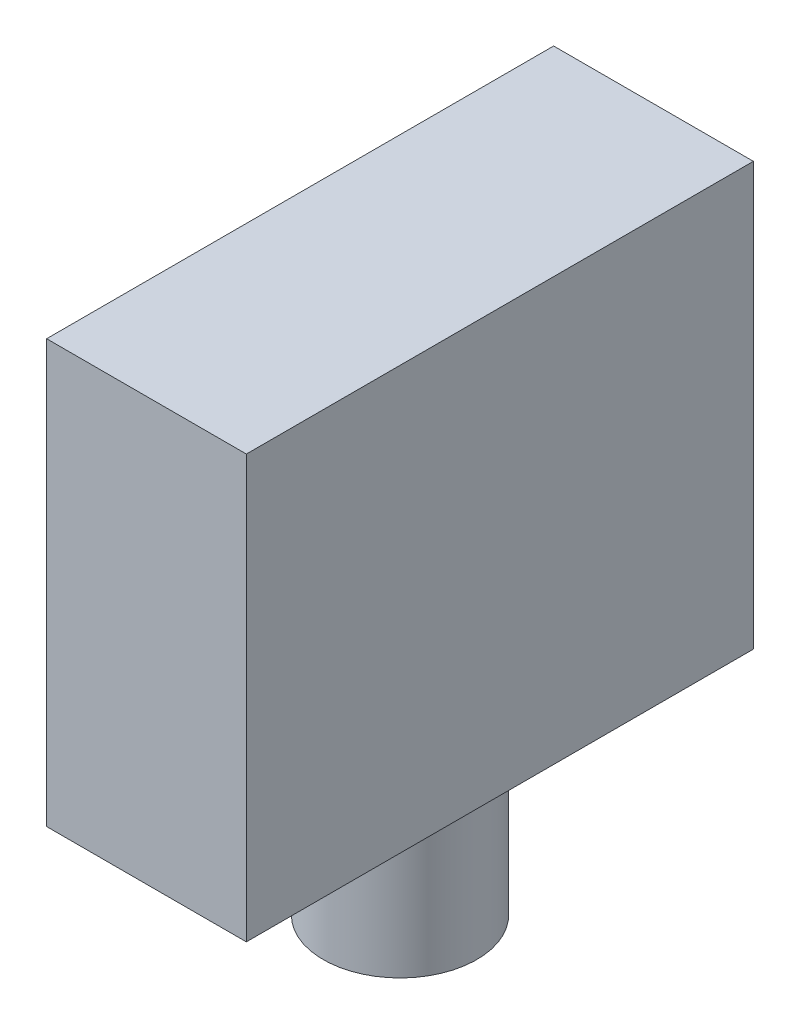
ISO-10303-21;
HEADER;
FILE_DESCRIPTION(('STEP AP214'),'2;1');
FILE_NAME('part.step','',(''),(''),'','','');
FILE_SCHEMA(('AUTOMOTIVE_DESIGN { 1 0 10303 214 1 1 1 1 }'));
ENDSEC;
DATA;
#1=APPLICATION_CONTEXT('core data for automotive mechanical design processes');
#2=APPLICATION_PROTOCOL_DEFINITION('international standard','automotive_design',2000,#1);
#3=PRODUCT_CONTEXT('',#1,'mechanical');
#4=PRODUCT('Part','Part','',(#3));
#5=PRODUCT_RELATED_PRODUCT_CATEGORY('part','',(#4));
#6=PRODUCT_DEFINITION_FORMATION('','',#4);
#7=PRODUCT_DEFINITION_CONTEXT('part definition',#1,'design');
#8=PRODUCT_DEFINITION('design','',#6,#7);
#9=PRODUCT_DEFINITION_SHAPE('','',#8);
#10=(LENGTH_UNIT() NAMED_UNIT(*) SI_UNIT(.MILLI.,.METRE.));
#11=(NAMED_UNIT(*) PLANE_ANGLE_UNIT() SI_UNIT($,.RADIAN.));
#12=(NAMED_UNIT(*) SI_UNIT($,.STERADIAN.) SOLID_ANGLE_UNIT());
#13=UNCERTAINTY_MEASURE_WITH_UNIT(LENGTH_MEASURE(1.E-05),#10,'distance_accuracy_value','');
#14=(GEOMETRIC_REPRESENTATION_CONTEXT(3) GLOBAL_UNCERTAINTY_ASSIGNED_CONTEXT((#13)) GLOBAL_UNIT_ASSIGNED_CONTEXT((#10,
#11,#12)) REPRESENTATION_CONTEXT('',''));
#15=CARTESIAN_POINT('',(0.,0.,0.));
#16=DIRECTION('',(0.,0.,1.));
#17=DIRECTION('',(1.,0.,0.));
#18=AXIS2_PLACEMENT_3D('',#15,#16,#17);
#19=CARTESIAN_POINT('',(-0.602941176470582,27.5,12.9411764705882));
#20=DIRECTION('',(-1.,0.,0.));
#21=DIRECTION('',(0.,0.,-1.));
#22=AXIS2_PLACEMENT_3D('',#19,#20,#21);
#23=PLANE('',#22);
#24=DIRECTION('',(0.,0.,1.));
#25=VECTOR('',#24,1.);
#26=CARTESIAN_POINT('',(-0.602941176470582,0.,12.9411764705882));
#27=LINE('',#26,#25);
#28=CARTESIAN_POINT('',(-0.60294117647058,0.,-20.0588235294118));
#29=VERTEX_POINT('',#28);
#30=CARTESIAN_POINT('',(-0.602941176470582,0.,12.9411764705882));
#31=VERTEX_POINT('',#30);
#32=EDGE_CURVE('E101',#29,#31,#27,.T.);
#33=ORIENTED_EDGE('',*,*,#32,.F.);
#34=DIRECTION('',(0.,-1.,0.));
#35=VECTOR('',#34,1.);
#36=CARTESIAN_POINT('',(-0.60294117647058,27.5,-20.0588235294118));
#37=LINE('',#36,#35);
#38=CARTESIAN_POINT('',(-0.60294117647058,27.5,-20.0588235294118));
#39=VERTEX_POINT('',#38);
#40=EDGE_CURVE('E100',#39,#29,#37,.T.);
#41=ORIENTED_EDGE('',*,*,#40,.F.);
#42=DIRECTION('',(0.,0.,1.));
#43=VECTOR('',#42,1.);
#44=CARTESIAN_POINT('',(-0.602941176470582,27.5,12.9411764705882));
#45=LINE('',#44,#43);
#46=CARTESIAN_POINT('',(-0.602941176470582,27.5,12.9411764705882));
#47=VERTEX_POINT('',#46);
#48=EDGE_CURVE('E94',#39,#47,#45,.T.);
#49=ORIENTED_EDGE('',*,*,#48,.T.);
#50=DIRECTION('',(0.,-1.,0.));
#51=VECTOR('',#50,1.);
#52=CARTESIAN_POINT('',(-0.602941176470582,27.5,12.9411764705882));
#53=LINE('',#52,#51);
#54=EDGE_CURVE('E11',#47,#31,#53,.T.);
#55=ORIENTED_EDGE('',*,*,#54,.T.);
#56=EDGE_LOOP('',(#33,#41,#49,#55));
#57=FACE_BOUND('',#56,.T.);
#58=ADVANCED_FACE('F37',(#57),#23,.F.);
#59=CARTESIAN_POINT('',(-0.602941176470582,27.5,12.9411764705882));
#60=DIRECTION('',(0.,0.,-1.));
#61=DIRECTION('',(1.,0.,0.));
#62=AXIS2_PLACEMENT_3D('',#59,#60,#61);
#63=PLANE('',#62);
#64=DIRECTION('',(-1.,0.,0.));
#65=VECTOR('',#64,1.);
#66=CARTESIAN_POINT('',(-0.602941176470582,0.,12.9411764705882));
#67=LINE('',#66,#65);
#68=CARTESIAN_POINT('',(-13.6029411764706,0.,12.9411764705882));
#69=VERTEX_POINT('',#68);
#70=EDGE_CURVE('E103',#31,#69,#67,.T.);
#71=ORIENTED_EDGE('',*,*,#70,.F.);
#72=ORIENTED_EDGE('',*,*,#54,.F.);
#73=DIRECTION('',(-1.,0.,0.));
#74=VECTOR('',#73,1.);
#75=CARTESIAN_POINT('',(-0.602941176470582,27.5,12.9411764705882));
#76=LINE('',#75,#74);
#77=CARTESIAN_POINT('',(-13.6029411764706,27.5,12.9411764705882));
#78=VERTEX_POINT('',#77);
#79=EDGE_CURVE('E78',#47,#78,#76,.T.);
#80=ORIENTED_EDGE('',*,*,#79,.T.);
#81=DIRECTION('',(0.,-1.,0.));
#82=VECTOR('',#81,1.);
#83=CARTESIAN_POINT('',(-13.6029411764706,27.5,12.9411764705882));
#84=LINE('',#83,#82);
#85=EDGE_CURVE('E45',#78,#69,#84,.T.);
#86=ORIENTED_EDGE('',*,*,#85,.T.);
#87=EDGE_LOOP('',(#71,#72,#80,#86));
#88=FACE_BOUND('',#87,.T.);
#89=ADVANCED_FACE('F92',(#88),#63,.F.);
#90=CARTESIAN_POINT('',(-13.6029411764706,27.5,12.9411764705882));
#91=DIRECTION('',(1.,0.,0.));
#92=DIRECTION('',(0.,0.,1.));
#93=AXIS2_PLACEMENT_3D('',#90,#91,#92);
#94=PLANE('',#93);
#95=DIRECTION('',(0.,0.,-1.));
#96=VECTOR('',#95,1.);
#97=CARTESIAN_POINT('',(-13.6029411764706,0.,12.9411764705882));
#98=LINE('',#97,#96);
#99=CARTESIAN_POINT('',(-13.6029411764706,0.,-20.0588235294118));
#100=VERTEX_POINT('',#99);
#101=EDGE_CURVE('E88',#69,#100,#98,.T.);
#102=ORIENTED_EDGE('',*,*,#101,.F.);
#103=ORIENTED_EDGE('',*,*,#85,.F.);
#104=DIRECTION('',(0.,0.,-1.));
#105=VECTOR('',#104,1.);
#106=CARTESIAN_POINT('',(-13.6029411764706,27.5,12.9411764705882));
#107=LINE('',#106,#105);
#108=CARTESIAN_POINT('',(-13.6029411764706,27.5,-20.0588235294118));
#109=VERTEX_POINT('',#108);
#110=EDGE_CURVE('E81',#78,#109,#107,.T.);
#111=ORIENTED_EDGE('',*,*,#110,.T.);
#112=DIRECTION('',(0.,-1.,0.));
#113=VECTOR('',#112,1.);
#114=CARTESIAN_POINT('',(-13.6029411764706,27.5,-20.0588235294118));
#115=LINE('',#114,#113);
#116=EDGE_CURVE('E91',#109,#100,#115,.T.);
#117=ORIENTED_EDGE('',*,*,#116,.T.);
#118=EDGE_LOOP('',(#102,#103,#111,#117));
#119=FACE_BOUND('',#118,.T.);
#120=ADVANCED_FACE('F87',(#119),#94,.F.);
#121=CARTESIAN_POINT('',(-0.60294117647058,27.5,-20.0588235294118));
#122=DIRECTION('',(0.,0.,1.));
#123=DIRECTION('',(-1.,0.,0.));
#124=AXIS2_PLACEMENT_3D('',#121,#122,#123);
#125=PLANE('',#124);
#126=DIRECTION('',(1.,0.,0.));
#127=VECTOR('',#126,1.);
#128=CARTESIAN_POINT('',(-0.60294117647058,0.,-20.0588235294118));
#129=LINE('',#128,#127);
#130=EDGE_CURVE('E67',#100,#29,#129,.T.);
#131=ORIENTED_EDGE('',*,*,#130,.F.);
#132=ORIENTED_EDGE('',*,*,#116,.F.);
#133=DIRECTION('',(1.,0.,0.));
#134=VECTOR('',#133,1.);
#135=CARTESIAN_POINT('',(-0.60294117647058,27.5,-20.0588235294118));
#136=LINE('',#135,#134);
#137=EDGE_CURVE('E53',#109,#39,#136,.T.);
#138=ORIENTED_EDGE('',*,*,#137,.T.);
#139=ORIENTED_EDGE('',*,*,#40,.T.);
#140=EDGE_LOOP('',(#131,#132,#138,#139));
#141=FACE_BOUND('',#140,.T.);
#142=ADVANCED_FACE('F113',(#141),#125,.F.);
#143=CARTESIAN_POINT('',(0.,27.5,0.));
#144=DIRECTION('',(0.,-1.,0.));
#145=DIRECTION('',(0.,0.,1.));
#146=AXIS2_PLACEMENT_3D('',#143,#144,#145);
#147=PLANE('',#146);
#148=ORIENTED_EDGE('',*,*,#48,.F.);
#149=ORIENTED_EDGE('',*,*,#137,.F.);
#150=ORIENTED_EDGE('',*,*,#110,.F.);
#151=ORIENTED_EDGE('',*,*,#79,.F.);
#152=EDGE_LOOP('',(#148,#149,#150,#151));
#153=FACE_BOUND('',#152,.T.);
#154=ADVANCED_FACE('F83',(#153),#147,.F.);
#155=CARTESIAN_POINT('',(0.,0.,0.));
#156=DIRECTION('',(0.,-1.,0.));
#157=DIRECTION('',(0.,0.,1.));
#158=AXIS2_PLACEMENT_3D('',#155,#156,#157);
#159=PLANE('',#158);
#160=CARTESIAN_POINT('',(-7.10294117647057,0.,-3.55882352941177));
#161=DIRECTION('',(0.,-1.,0.));
#162=DIRECTION('',(0.,0.,-1.));
#163=AXIS2_PLACEMENT_3D('',#160,#161,#162);
#164=CIRCLE('',#163,5.);
#165=CARTESIAN_POINT('',(-7.10294117647057,0.,-8.55882352941176));
#166=VERTEX_POINT('',#165);
#167=EDGE_CURVE('E177',#166,#166,#164,.T.);
#168=ORIENTED_EDGE('',*,*,#167,.F.);
#169=EDGE_LOOP('',(#168));
#170=FACE_BOUND('',#169,.T.);
#171=ORIENTED_EDGE('',*,*,#32,.T.);
#172=ORIENTED_EDGE('',*,*,#70,.T.);
#173=ORIENTED_EDGE('',*,*,#101,.T.);
#174=ORIENTED_EDGE('',*,*,#130,.T.);
#175=EDGE_LOOP('',(#171,#172,#173,#174));
#176=FACE_BOUND('',#175,.T.);
#177=ADVANCED_FACE('F109',(#170,#176),#159,.T.);
#178=CARTESIAN_POINT('',(-7.10294117647057,-10.,-3.55882352941177));
#179=DIRECTION('',(0.,1.,0.));
#180=DIRECTION('',(0.,0.,-1.));
#181=AXIS2_PLACEMENT_3D('',#178,#179,#180);
#182=CYLINDRICAL_SURFACE('',#181,5.);
#183=CARTESIAN_POINT('',(-7.10294117647057,-10.,-3.55882352941177));
#184=DIRECTION('',(0.,-1.,0.));
#185=DIRECTION('',(0.,0.,-1.));
#186=AXIS2_PLACEMENT_3D('',#183,#184,#185);
#187=CIRCLE('',#186,5.);
#188=CARTESIAN_POINT('',(-7.10294117647057,-10.,-8.55882352941176));
#189=VERTEX_POINT('',#188);
#190=EDGE_CURVE('E104',#189,#189,#187,.T.);
#191=ORIENTED_EDGE('',*,*,#190,.F.);
#192=EDGE_LOOP('',(#191));
#193=FACE_BOUND('',#192,.T.);
#194=ORIENTED_EDGE('',*,*,#167,.T.);
#195=EDGE_LOOP('',(#194));
#196=FACE_BOUND('',#195,.T.);
#197=ADVANCED_FACE('F152',(#193,#196),#182,.T.);
#198=CARTESIAN_POINT('',(-7.10294117647057,-10.,-3.55882352941177));
#199=DIRECTION('',(0.,1.,0.));
#200=DIRECTION('',(0.,0.,-1.));
#201=AXIS2_PLACEMENT_3D('',#198,#199,#200);
#202=PLANE('',#201);
#203=ORIENTED_EDGE('',*,*,#190,.T.);
#204=EDGE_LOOP('',(#203));
#205=FACE_BOUND('',#204,.T.);
#206=ADVANCED_FACE('F161',(#205),#202,.F.);
#207=CLOSED_SHELL('',(#58,#89,#120,#142,#154,#177,#197,#206));
#208=MANIFOLD_SOLID_BREP('B2',#207);
#209=ADVANCED_BREP_SHAPE_REPRESENTATION('',(#18,#208),#14);
#210=SHAPE_DEFINITION_REPRESENTATION(#9,#209);
ENDSEC;
END-ISO-10303-21;
